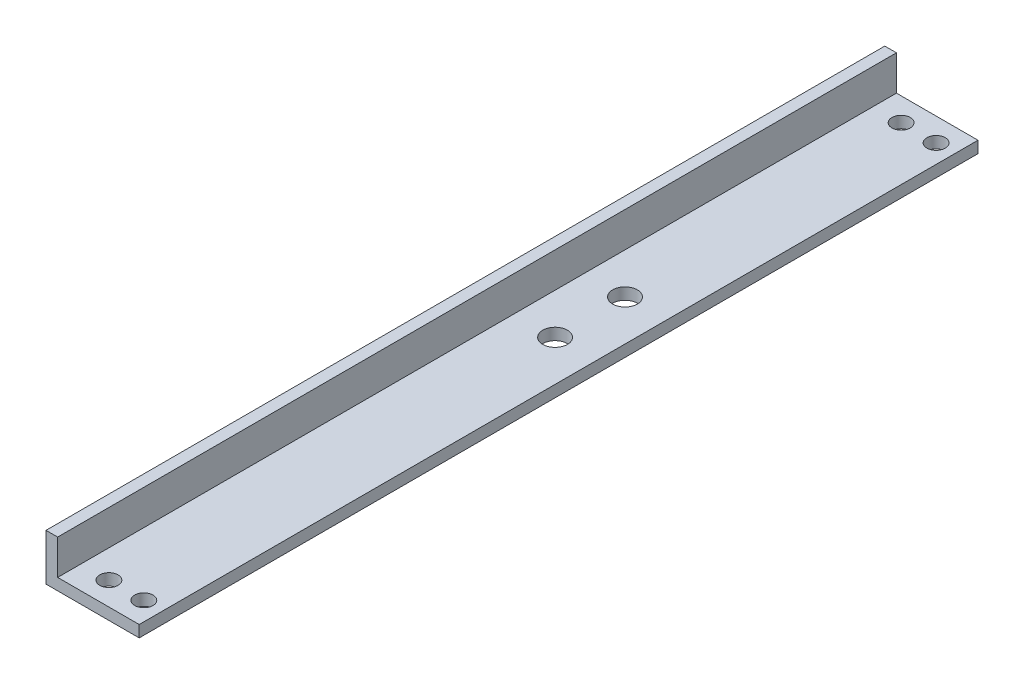
ISO-10303-21;
HEADER;
FILE_DESCRIPTION(('STEP AP214'),'2;1');
FILE_NAME('part.step','',(''),(''),'','','');
FILE_SCHEMA(('AUTOMOTIVE_DESIGN { 1 0 10303 214 1 1 1 1 }'));
ENDSEC;
DATA;
#1=APPLICATION_CONTEXT('core data for automotive mechanical design processes');
#2=APPLICATION_PROTOCOL_DEFINITION('international standard','automotive_design',2000,#1);
#3=PRODUCT_CONTEXT('',#1,'mechanical');
#4=PRODUCT('Part','Part','',(#3));
#5=PRODUCT_RELATED_PRODUCT_CATEGORY('part','',(#4));
#6=PRODUCT_DEFINITION_FORMATION('','',#4);
#7=PRODUCT_DEFINITION_CONTEXT('part definition',#1,'design');
#8=PRODUCT_DEFINITION('design','',#6,#7);
#9=PRODUCT_DEFINITION_SHAPE('','',#8);
#10=(LENGTH_UNIT() NAMED_UNIT(*) SI_UNIT(.MILLI.,.METRE.));
#11=(NAMED_UNIT(*) PLANE_ANGLE_UNIT() SI_UNIT($,.RADIAN.));
#12=(NAMED_UNIT(*) SI_UNIT($,.STERADIAN.) SOLID_ANGLE_UNIT());
#13=UNCERTAINTY_MEASURE_WITH_UNIT(LENGTH_MEASURE(1.E-05),#10,'distance_accuracy_value','');
#14=(GEOMETRIC_REPRESENTATION_CONTEXT(3) GLOBAL_UNCERTAINTY_ASSIGNED_CONTEXT((#13)) GLOBAL_UNIT_ASSIGNED_CONTEXT((#10,
#11,#12)) REPRESENTATION_CONTEXT('',''));
#15=CARTESIAN_POINT('',(0.,0.,0.));
#16=DIRECTION('',(0.,0.,1.));
#17=DIRECTION('',(1.,0.,0.));
#18=AXIS2_PLACEMENT_3D('',#15,#16,#17);
#19=CARTESIAN_POINT('',(0.,0.,228.6));
#20=DIRECTION('',(0.,1.,0.));
#21=DIRECTION('',(0.,0.,1.));
#22=AXIS2_PLACEMENT_3D('',#19,#20,#21);
#23=PLANE('',#22);
#24=CARTESIAN_POINT('',(14.2875,0.,85.09));
#25=DIRECTION('',(0.,1.,0.));
#26=DIRECTION('',(-1.,0.,0.));
#27=AXIS2_PLACEMENT_3D('',#24,#25,#26);
#28=CIRCLE('',#27,3.36549999999999);
#29=CARTESIAN_POINT('',(10.922,0.,85.09));
#30=VERTEX_POINT('',#29);
#31=EDGE_CURVE('E138',#30,#30,#28,.T.);
#32=ORIENTED_EDGE('',*,*,#31,.T.);
#33=EDGE_LOOP('',(#32));
#34=FACE_BOUND('',#33,.T.);
#35=CARTESIAN_POINT('',(14.2875,0.,104.14));
#36=DIRECTION('',(0.,1.,0.));
#37=DIRECTION('',(-1.,0.,0.));
#38=AXIS2_PLACEMENT_3D('',#35,#36,#37);
#39=CIRCLE('',#38,3.36549999999999);
#40=CARTESIAN_POINT('',(10.922,0.,104.14));
#41=VERTEX_POINT('',#40);
#42=EDGE_CURVE('E221',#41,#41,#39,.T.);
#43=ORIENTED_EDGE('',*,*,#42,.T.);
#44=EDGE_LOOP('',(#43));
#45=FACE_BOUND('',#44,.T.);
#46=CARTESIAN_POINT('',(10.795,0.,222.25));
#47=DIRECTION('',(0.,1.,0.));
#48=DIRECTION('',(-1.,0.,0.));
#49=AXIS2_PLACEMENT_3D('',#46,#47,#48);
#50=CIRCLE('',#49,2.48920000000002);
#51=CARTESIAN_POINT('',(8.30579999999998,0.,222.25));
#52=VERTEX_POINT('',#51);
#53=EDGE_CURVE('E153',#52,#52,#50,.T.);
#54=ORIENTED_EDGE('',*,*,#53,.T.);
#55=EDGE_LOOP('',(#54));
#56=FACE_BOUND('',#55,.T.);
#57=CARTESIAN_POINT('',(20.32,0.,6.34999999999999));
#58=DIRECTION('',(0.,1.,0.));
#59=DIRECTION('',(1.,0.,0.));
#60=AXIS2_PLACEMENT_3D('',#57,#58,#59);
#61=CIRCLE('',#60,2.48920000000001);
#62=CARTESIAN_POINT('',(22.8092,0.,6.34999999999999));
#63=VERTEX_POINT('',#62);
#64=EDGE_CURVE('E160',#63,#63,#61,.T.);
#65=ORIENTED_EDGE('',*,*,#64,.T.);
#66=EDGE_LOOP('',(#65));
#67=FACE_BOUND('',#66,.T.);
#68=CARTESIAN_POINT('',(10.795,0.,6.34999999999999));
#69=DIRECTION('',(0.,1.,0.));
#70=DIRECTION('',(1.,0.,0.));
#71=AXIS2_PLACEMENT_3D('',#68,#69,#70);
#72=CIRCLE('',#71,2.48920000000001);
#73=CARTESIAN_POINT('',(13.2842,0.,6.34999999999999));
#74=VERTEX_POINT('',#73);
#75=EDGE_CURVE('E147',#74,#74,#72,.T.);
#76=ORIENTED_EDGE('',*,*,#75,.T.);
#77=EDGE_LOOP('',(#76));
#78=FACE_BOUND('',#77,.T.);
#79=CARTESIAN_POINT('',(20.32,0.,222.25));
#80=DIRECTION('',(0.,1.,0.));
#81=DIRECTION('',(-1.,0.,0.));
#82=AXIS2_PLACEMENT_3D('',#79,#80,#81);
#83=CIRCLE('',#82,2.48920000000002);
#84=CARTESIAN_POINT('',(17.8308,0.,222.25));
#85=VERTEX_POINT('',#84);
#86=EDGE_CURVE('E116',#85,#85,#83,.T.);
#87=ORIENTED_EDGE('',*,*,#86,.T.);
#88=EDGE_LOOP('',(#87));
#89=FACE_BOUND('',#88,.T.);
#90=DIRECTION('',(1.,0.,0.));
#91=VECTOR('',#90,1.);
#92=CARTESIAN_POINT('',(0.,0.,0.));
#93=LINE('',#92,#91);
#94=CARTESIAN_POINT('',(0.,0.,0.));
#95=VERTEX_POINT('',#94);
#96=CARTESIAN_POINT('',(25.4,0.,0.));
#97=VERTEX_POINT('',#96);
#98=EDGE_CURVE('E112',#95,#97,#93,.T.);
#99=ORIENTED_EDGE('',*,*,#98,.T.);
#100=DIRECTION('',(0.,0.,-1.));
#101=VECTOR('',#100,1.);
#102=CARTESIAN_POINT('',(25.4,0.,228.6));
#103=LINE('',#102,#101);
#104=CARTESIAN_POINT('',(25.4,0.,228.6));
#105=VERTEX_POINT('',#104);
#106=EDGE_CURVE('E11',#105,#97,#103,.T.);
#107=ORIENTED_EDGE('',*,*,#106,.F.);
#108=DIRECTION('',(1.,0.,0.));
#109=VECTOR('',#108,1.);
#110=CARTESIAN_POINT('',(0.,0.,228.6));
#111=LINE('',#110,#109);
#112=CARTESIAN_POINT('',(0.,0.,228.6));
#113=VERTEX_POINT('',#112);
#114=EDGE_CURVE('E123',#113,#105,#111,.T.);
#115=ORIENTED_EDGE('',*,*,#114,.F.);
#116=DIRECTION('',(0.,0.,-1.));
#117=VECTOR('',#116,1.);
#118=CARTESIAN_POINT('',(0.,0.,228.6));
#119=LINE('',#118,#117);
#120=EDGE_CURVE('E103',#113,#95,#119,.T.);
#121=ORIENTED_EDGE('',*,*,#120,.T.);
#122=EDGE_LOOP('',(#99,#107,#115,#121));
#123=FACE_BOUND('',#122,.T.);
#124=ADVANCED_FACE('F33',(#34,#45,#56,#67,#78,#89,#123),#23,.F.);
#125=CARTESIAN_POINT('',(25.4,0.,228.6));
#126=DIRECTION('',(-1.,0.,0.));
#127=DIRECTION('',(0.,0.,1.));
#128=AXIS2_PLACEMENT_3D('',#125,#126,#127);
#129=PLANE('',#128);
#130=DIRECTION('',(0.,1.,0.));
#131=VECTOR('',#130,1.);
#132=CARTESIAN_POINT('',(25.4,0.,0.));
#133=LINE('',#132,#131);
#134=CARTESIAN_POINT('',(25.4,3.175,0.));
#135=VERTEX_POINT('',#134);
#136=EDGE_CURVE('E115',#97,#135,#133,.T.);
#137=ORIENTED_EDGE('',*,*,#136,.T.);
#138=DIRECTION('',(0.,0.,-1.));
#139=VECTOR('',#138,1.);
#140=CARTESIAN_POINT('',(25.4,3.175,228.6));
#141=LINE('',#140,#139);
#142=CARTESIAN_POINT('',(25.4,3.175,228.6));
#143=VERTEX_POINT('',#142);
#144=EDGE_CURVE('E40',#143,#135,#141,.T.);
#145=ORIENTED_EDGE('',*,*,#144,.F.);
#146=DIRECTION('',(0.,1.,0.));
#147=VECTOR('',#146,1.);
#148=CARTESIAN_POINT('',(25.4,0.,228.6));
#149=LINE('',#148,#147);
#150=EDGE_CURVE('E85',#105,#143,#149,.T.);
#151=ORIENTED_EDGE('',*,*,#150,.F.);
#152=ORIENTED_EDGE('',*,*,#106,.T.);
#153=EDGE_LOOP('',(#137,#145,#151,#152));
#154=FACE_BOUND('',#153,.T.);
#155=ADVANCED_FACE('F172',(#154),#129,.F.);
#156=CARTESIAN_POINT('',(25.4,3.175,228.6));
#157=DIRECTION('',(0.,-1.,0.));
#158=DIRECTION('',(1.,0.,0.));
#159=AXIS2_PLACEMENT_3D('',#156,#157,#158);
#160=PLANE('',#159);
#161=CARTESIAN_POINT('',(14.2875,3.175,85.09));
#162=DIRECTION('',(0.,1.,0.));
#163=DIRECTION('',(-1.,0.,0.));
#164=AXIS2_PLACEMENT_3D('',#161,#162,#163);
#165=CIRCLE('',#164,3.36549999999999);
#166=CARTESIAN_POINT('',(10.922,3.175,85.09));
#167=VERTEX_POINT('',#166);
#168=EDGE_CURVE('E141',#167,#167,#165,.T.);
#169=ORIENTED_EDGE('',*,*,#168,.F.);
#170=EDGE_LOOP('',(#169));
#171=FACE_BOUND('',#170,.T.);
#172=CARTESIAN_POINT('',(14.2875,3.175,104.14));
#173=DIRECTION('',(0.,1.,0.));
#174=DIRECTION('',(-1.,0.,0.));
#175=AXIS2_PLACEMENT_3D('',#172,#173,#174);
#176=CIRCLE('',#175,3.36549999999999);
#177=CARTESIAN_POINT('',(10.922,3.175,104.14));
#178=VERTEX_POINT('',#177);
#179=EDGE_CURVE('E224',#178,#178,#176,.T.);
#180=ORIENTED_EDGE('',*,*,#179,.F.);
#181=EDGE_LOOP('',(#180));
#182=FACE_BOUND('',#181,.T.);
#183=CARTESIAN_POINT('',(10.795,3.175,222.25));
#184=DIRECTION('',(0.,1.,0.));
#185=DIRECTION('',(-1.,0.,0.));
#186=AXIS2_PLACEMENT_3D('',#183,#184,#185);
#187=CIRCLE('',#186,2.48920000000002);
#188=CARTESIAN_POINT('',(8.30579999999998,3.175,222.25));
#189=VERTEX_POINT('',#188);
#190=EDGE_CURVE('E157',#189,#189,#187,.T.);
#191=ORIENTED_EDGE('',*,*,#190,.F.);
#192=EDGE_LOOP('',(#191));
#193=FACE_BOUND('',#192,.T.);
#194=CARTESIAN_POINT('',(20.32,3.175,6.34999999999999));
#195=DIRECTION('',(0.,1.,0.));
#196=DIRECTION('',(1.,0.,0.));
#197=AXIS2_PLACEMENT_3D('',#194,#195,#196);
#198=CIRCLE('',#197,2.48920000000001);
#199=CARTESIAN_POINT('',(22.8092,3.175,6.34999999999999));
#200=VERTEX_POINT('',#199);
#201=EDGE_CURVE('E150',#200,#200,#198,.T.);
#202=ORIENTED_EDGE('',*,*,#201,.F.);
#203=EDGE_LOOP('',(#202));
#204=FACE_BOUND('',#203,.T.);
#205=CARTESIAN_POINT('',(10.795,3.175,6.34999999999999));
#206=DIRECTION('',(0.,1.,0.));
#207=DIRECTION('',(1.,0.,0.));
#208=AXIS2_PLACEMENT_3D('',#205,#206,#207);
#209=CIRCLE('',#208,2.48920000000001);
#210=CARTESIAN_POINT('',(13.2842,3.175,6.34999999999999));
#211=VERTEX_POINT('',#210);
#212=EDGE_CURVE('E145',#211,#211,#209,.T.);
#213=ORIENTED_EDGE('',*,*,#212,.F.);
#214=EDGE_LOOP('',(#213));
#215=FACE_BOUND('',#214,.T.);
#216=CARTESIAN_POINT('',(20.32,3.175,222.25));
#217=DIRECTION('',(0.,1.,0.));
#218=DIRECTION('',(-1.,0.,0.));
#219=AXIS2_PLACEMENT_3D('',#216,#217,#218);
#220=CIRCLE('',#219,2.48920000000002);
#221=CARTESIAN_POINT('',(17.8308,3.175,222.25));
#222=VERTEX_POINT('',#221);
#223=EDGE_CURVE('E156',#222,#222,#220,.T.);
#224=ORIENTED_EDGE('',*,*,#223,.F.);
#225=EDGE_LOOP('',(#224));
#226=FACE_BOUND('',#225,.T.);
#227=DIRECTION('',(-1.,0.,0.));
#228=VECTOR('',#227,1.);
#229=CARTESIAN_POINT('',(25.4,3.175,0.));
#230=LINE('',#229,#228);
#231=CARTESIAN_POINT('',(3.175,3.175,0.));
#232=VERTEX_POINT('',#231);
#233=EDGE_CURVE('E118',#135,#232,#230,.T.);
#234=ORIENTED_EDGE('',*,*,#233,.T.);
#235=DIRECTION('',(0.,0.,-1.));
#236=VECTOR('',#235,1.);
#237=CARTESIAN_POINT('',(3.175,3.175,228.6));
#238=LINE('',#237,#236);
#239=CARTESIAN_POINT('',(3.175,3.175,228.6));
#240=VERTEX_POINT('',#239);
#241=EDGE_CURVE('E106',#240,#232,#238,.T.);
#242=ORIENTED_EDGE('',*,*,#241,.F.);
#243=DIRECTION('',(-1.,0.,0.));
#244=VECTOR('',#243,1.);
#245=CARTESIAN_POINT('',(25.4,3.175,228.6));
#246=LINE('',#245,#244);
#247=EDGE_CURVE('E108',#143,#240,#246,.T.);
#248=ORIENTED_EDGE('',*,*,#247,.F.);
#249=ORIENTED_EDGE('',*,*,#144,.T.);
#250=EDGE_LOOP('',(#234,#242,#248,#249));
#251=FACE_BOUND('',#250,.T.);
#252=ADVANCED_FACE('F130',(#171,#182,#193,#204,#215,#226,#251),#160,.F.);
#253=CARTESIAN_POINT('',(3.175,3.175,228.6));
#254=DIRECTION('',(-1.,0.,0.));
#255=DIRECTION('',(0.,-1.,0.));
#256=AXIS2_PLACEMENT_3D('',#253,#254,#255);
#257=PLANE('',#256);
#258=DIRECTION('',(0.,1.,0.));
#259=VECTOR('',#258,1.);
#260=CARTESIAN_POINT('',(3.175,3.175,0.));
#261=LINE('',#260,#259);
#262=CARTESIAN_POINT('',(3.175,12.7,0.));
#263=VERTEX_POINT('',#262);
#264=EDGE_CURVE('E120',#232,#263,#261,.T.);
#265=ORIENTED_EDGE('',*,*,#264,.T.);
#266=DIRECTION('',(0.,0.,-1.));
#267=VECTOR('',#266,1.);
#268=CARTESIAN_POINT('',(3.175,12.7,228.6));
#269=LINE('',#268,#267);
#270=CARTESIAN_POINT('',(3.175,12.7,228.6));
#271=VERTEX_POINT('',#270);
#272=EDGE_CURVE('E47',#271,#263,#269,.T.);
#273=ORIENTED_EDGE('',*,*,#272,.F.);
#274=DIRECTION('',(0.,1.,0.));
#275=VECTOR('',#274,1.);
#276=CARTESIAN_POINT('',(3.175,3.175,228.6));
#277=LINE('',#276,#275);
#278=EDGE_CURVE('E100',#240,#271,#277,.T.);
#279=ORIENTED_EDGE('',*,*,#278,.F.);
#280=ORIENTED_EDGE('',*,*,#241,.T.);
#281=EDGE_LOOP('',(#265,#273,#279,#280));
#282=FACE_BOUND('',#281,.T.);
#283=ADVANCED_FACE('F137',(#282),#257,.F.);
#284=CARTESIAN_POINT('',(0.,0.,228.6));
#285=DIRECTION('',(1.,0.,0.));
#286=DIRECTION('',(0.,0.,-1.));
#287=AXIS2_PLACEMENT_3D('',#284,#285,#286);
#288=PLANE('',#287);
#289=DIRECTION('',(0.,-1.,0.));
#290=VECTOR('',#289,1.);
#291=CARTESIAN_POINT('',(0.,0.,228.6));
#292=LINE('',#291,#290);
#293=CARTESIAN_POINT('',(0.,12.7,228.6));
#294=VERTEX_POINT('',#293);
#295=EDGE_CURVE('E56',#294,#113,#292,.T.);
#296=ORIENTED_EDGE('',*,*,#295,.F.);
#297=DIRECTION('',(0.,0.,-1.));
#298=VECTOR('',#297,1.);
#299=CARTESIAN_POINT('',(0.,12.7,228.6));
#300=LINE('',#299,#298);
#301=CARTESIAN_POINT('',(0.,12.7,0.));
#302=VERTEX_POINT('',#301);
#303=EDGE_CURVE('E92',#294,#302,#300,.T.);
#304=ORIENTED_EDGE('',*,*,#303,.T.);
#305=DIRECTION('',(0.,-1.,0.));
#306=VECTOR('',#305,1.);
#307=CARTESIAN_POINT('',(0.,0.,0.));
#308=LINE('',#307,#306);
#309=EDGE_CURVE('E78',#302,#95,#308,.T.);
#310=ORIENTED_EDGE('',*,*,#309,.T.);
#311=ORIENTED_EDGE('',*,*,#120,.F.);
#312=EDGE_LOOP('',(#296,#304,#310,#311));
#313=FACE_BOUND('',#312,.T.);
#314=ADVANCED_FACE('F102',(#313),#288,.F.);
#315=CARTESIAN_POINT('',(0.,0.,228.6));
#316=DIRECTION('',(0.,0.,1.));
#317=DIRECTION('',(1.,0.,0.));
#318=AXIS2_PLACEMENT_3D('',#315,#316,#317);
#319=PLANE('',#318);
#320=DIRECTION('',(1.,0.,0.));
#321=VECTOR('',#320,1.);
#322=CARTESIAN_POINT('',(0.,12.7,228.6));
#323=LINE('',#322,#321);
#324=EDGE_CURVE('E94',#294,#271,#323,.T.);
#325=ORIENTED_EDGE('',*,*,#324,.F.);
#326=ORIENTED_EDGE('',*,*,#295,.T.);
#327=ORIENTED_EDGE('',*,*,#114,.T.);
#328=ORIENTED_EDGE('',*,*,#150,.T.);
#329=ORIENTED_EDGE('',*,*,#247,.T.);
#330=ORIENTED_EDGE('',*,*,#278,.T.);
#331=EDGE_LOOP('',(#325,#326,#327,#328,#329,#330));
#332=FACE_BOUND('',#331,.T.);
#333=ADVANCED_FACE('F98',(#332),#319,.T.);
#334=CARTESIAN_POINT('',(0.,0.,0.));
#335=DIRECTION('',(0.,0.,1.));
#336=DIRECTION('',(1.,0.,0.));
#337=AXIS2_PLACEMENT_3D('',#334,#335,#336);
#338=PLANE('',#337);
#339=ORIENTED_EDGE('',*,*,#309,.F.);
#340=DIRECTION('',(1.,0.,0.));
#341=VECTOR('',#340,1.);
#342=CARTESIAN_POINT('',(0.,12.7,0.));
#343=LINE('',#342,#341);
#344=EDGE_CURVE('E95',#302,#263,#343,.T.);
#345=ORIENTED_EDGE('',*,*,#344,.T.);
#346=ORIENTED_EDGE('',*,*,#264,.F.);
#347=ORIENTED_EDGE('',*,*,#233,.F.);
#348=ORIENTED_EDGE('',*,*,#136,.F.);
#349=ORIENTED_EDGE('',*,*,#98,.F.);
#350=EDGE_LOOP('',(#339,#345,#346,#347,#348,#349));
#351=FACE_BOUND('',#350,.T.);
#352=ADVANCED_FACE('F134',(#351),#338,.F.);
#353=CARTESIAN_POINT('',(20.32,0.,222.25));
#354=DIRECTION('',(0.,1.,0.));
#355=DIRECTION('',(-1.,0.,0.));
#356=AXIS2_PLACEMENT_3D('',#353,#354,#355);
#357=CYLINDRICAL_SURFACE('',#356,2.48920000000002);
#358=ORIENTED_EDGE('',*,*,#86,.F.);
#359=EDGE_LOOP('',(#358));
#360=FACE_BOUND('',#359,.T.);
#361=ORIENTED_EDGE('',*,*,#223,.T.);
#362=EDGE_LOOP('',(#361));
#363=FACE_BOUND('',#362,.T.);
#364=ADVANCED_FACE('F188',(#360,#363),#357,.F.);
#365=CARTESIAN_POINT('',(10.795,0.,6.34999999999999));
#366=DIRECTION('',(0.,1.,0.));
#367=DIRECTION('',(-1.,0.,0.));
#368=AXIS2_PLACEMENT_3D('',#365,#366,#367);
#369=CYLINDRICAL_SURFACE('',#368,2.48920000000001);
#370=ORIENTED_EDGE('',*,*,#75,.F.);
#371=EDGE_LOOP('',(#370));
#372=FACE_BOUND('',#371,.T.);
#373=ORIENTED_EDGE('',*,*,#212,.T.);
#374=EDGE_LOOP('',(#373));
#375=FACE_BOUND('',#374,.T.);
#376=ADVANCED_FACE('F193',(#372,#375),#369,.F.);
#377=CARTESIAN_POINT('',(20.32,0.,6.34999999999999));
#378=DIRECTION('',(0.,1.,0.));
#379=DIRECTION('',(-1.,0.,0.));
#380=AXIS2_PLACEMENT_3D('',#377,#378,#379);
#381=CYLINDRICAL_SURFACE('',#380,2.48920000000001);
#382=ORIENTED_EDGE('',*,*,#64,.F.);
#383=EDGE_LOOP('',(#382));
#384=FACE_BOUND('',#383,.T.);
#385=ORIENTED_EDGE('',*,*,#201,.T.);
#386=EDGE_LOOP('',(#385));
#387=FACE_BOUND('',#386,.T.);
#388=ADVANCED_FACE('F195',(#384,#387),#381,.F.);
#389=CARTESIAN_POINT('',(10.795,0.,222.25));
#390=DIRECTION('',(0.,1.,0.));
#391=DIRECTION('',(-1.,0.,0.));
#392=AXIS2_PLACEMENT_3D('',#389,#390,#391);
#393=CYLINDRICAL_SURFACE('',#392,2.48920000000002);
#394=ORIENTED_EDGE('',*,*,#53,.F.);
#395=EDGE_LOOP('',(#394));
#396=FACE_BOUND('',#395,.T.);
#397=ORIENTED_EDGE('',*,*,#190,.T.);
#398=EDGE_LOOP('',(#397));
#399=FACE_BOUND('',#398,.T.);
#400=ADVANCED_FACE('F198',(#396,#399),#393,.F.);
#401=CARTESIAN_POINT('',(0.,12.7,228.6));
#402=DIRECTION('',(0.,-1.,0.));
#403=DIRECTION('',(1.,0.,0.));
#404=AXIS2_PLACEMENT_3D('',#401,#402,#403);
#405=PLANE('',#404);
#406=ORIENTED_EDGE('',*,*,#272,.T.);
#407=ORIENTED_EDGE('',*,*,#344,.F.);
#408=ORIENTED_EDGE('',*,*,#303,.F.);
#409=ORIENTED_EDGE('',*,*,#324,.T.);
#410=EDGE_LOOP('',(#406,#407,#408,#409));
#411=FACE_BOUND('',#410,.T.);
#412=ADVANCED_FACE('F93',(#411),#405,.F.);
#413=CARTESIAN_POINT('',(14.2875,0.,104.14));
#414=DIRECTION('',(0.,1.,0.));
#415=DIRECTION('',(-1.,0.,0.));
#416=AXIS2_PLACEMENT_3D('',#413,#414,#415);
#417=CYLINDRICAL_SURFACE('',#416,3.36549999999999);
#418=ORIENTED_EDGE('',*,*,#42,.F.);
#419=EDGE_LOOP('',(#418));
#420=FACE_BOUND('',#419,.T.);
#421=ORIENTED_EDGE('',*,*,#179,.T.);
#422=EDGE_LOOP('',(#421));
#423=FACE_BOUND('',#422,.T.);
#424=ADVANCED_FACE('F208',(#420,#423),#417,.F.);
#425=CARTESIAN_POINT('',(14.2875,0.,85.09));
#426=DIRECTION('',(0.,1.,0.));
#427=DIRECTION('',(-1.,0.,0.));
#428=AXIS2_PLACEMENT_3D('',#425,#426,#427);
#429=CYLINDRICAL_SURFACE('',#428,3.36549999999999);
#430=ORIENTED_EDGE('',*,*,#31,.F.);
#431=EDGE_LOOP('',(#430));
#432=FACE_BOUND('',#431,.T.);
#433=ORIENTED_EDGE('',*,*,#168,.T.);
#434=EDGE_LOOP('',(#433));
#435=FACE_BOUND('',#434,.T.);
#436=ADVANCED_FACE('F211',(#432,#435),#429,.F.);
#437=CLOSED_SHELL('',(#124,#155,#252,#283,#314,#333,#352,#364,#376,#388,#400,#412,#424,#436));
#438=MANIFOLD_SOLID_BREP('B2',#437);
#439=ADVANCED_BREP_SHAPE_REPRESENTATION('',(#18,#438),#14);
#440=SHAPE_DEFINITION_REPRESENTATION(#9,#439);
ENDSEC;
END-ISO-10303-21;
